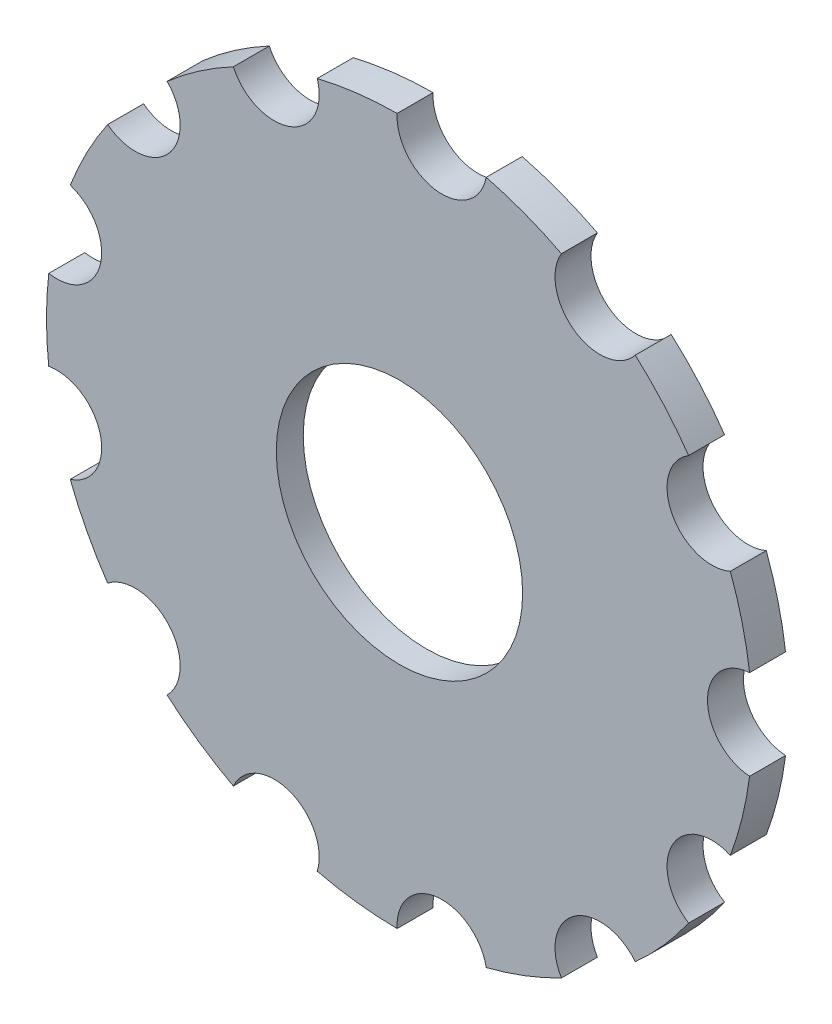
ISO-10303-21;
HEADER;
FILE_DESCRIPTION(('STEP AP214'),'2;1');
FILE_NAME('part.step','',(''),(''),'','','');
FILE_SCHEMA(('AUTOMOTIVE_DESIGN { 1 0 10303 214 1 1 1 1 }'));
ENDSEC;
DATA;
#1=APPLICATION_CONTEXT('core data for automotive mechanical design processes');
#2=APPLICATION_PROTOCOL_DEFINITION('international standard','automotive_design',2000,#1);
#3=PRODUCT_CONTEXT('',#1,'mechanical');
#4=PRODUCT('Part','Part','',(#3));
#5=PRODUCT_RELATED_PRODUCT_CATEGORY('part','',(#4));
#6=PRODUCT_DEFINITION_FORMATION('','',#4);
#7=PRODUCT_DEFINITION_CONTEXT('part definition',#1,'design');
#8=PRODUCT_DEFINITION('design','',#6,#7);
#9=PRODUCT_DEFINITION_SHAPE('','',#8);
#10=(LENGTH_UNIT() NAMED_UNIT(*) SI_UNIT(.MILLI.,.METRE.));
#11=(NAMED_UNIT(*) PLANE_ANGLE_UNIT() SI_UNIT($,.RADIAN.));
#12=(NAMED_UNIT(*) SI_UNIT($,.STERADIAN.) SOLID_ANGLE_UNIT());
#13=UNCERTAINTY_MEASURE_WITH_UNIT(LENGTH_MEASURE(1.E-05),#10,'distance_accuracy_value','');
#14=(GEOMETRIC_REPRESENTATION_CONTEXT(3) GLOBAL_UNCERTAINTY_ASSIGNED_CONTEXT((#13)) GLOBAL_UNIT_ASSIGNED_CONTEXT((#10,
#11,#12)) REPRESENTATION_CONTEXT('',''));
#15=CARTESIAN_POINT('',(0.,0.,0.));
#16=DIRECTION('',(0.,0.,1.));
#17=DIRECTION('',(1.,0.,0.));
#18=AXIS2_PLACEMENT_3D('',#15,#16,#17);
#19=CARTESIAN_POINT('',(-15.5805942177773,3.11525240540506,-0.508));
#20=DIRECTION('',(0.,0.,-1.));
#21=DIRECTION('',(-1.,0.,0.));
#22=AXIS2_PLACEMENT_3D('',#19,#20,#21);
#23=CYLINDRICAL_SURFACE('',#22,2.921);
#24=CARTESIAN_POINT('',(-15.5805942177773,3.11525240540506,-0.381));
#25=DIRECTION('',(0.,0.,-1.));
#26=DIRECTION('',(-1.,0.,0.));
#27=AXIS2_PLACEMENT_3D('',#24,#25,#26);
#28=CIRCLE('',#27,2.921);
#29=CARTESIAN_POINT('',(-18.5015942177773,3.11525240540506,-0.381));
#30=VERTEX_POINT('',#29);
#31=EDGE_CURVE('E203',#30,#30,#28,.T.);
#32=ORIENTED_EDGE('',*,*,#31,.F.);
#33=EDGE_LOOP('',(#32));
#34=FACE_BOUND('',#33,.T.);
#35=CARTESIAN_POINT('',(-15.5805942177773,3.11525240540506,-0.508));
#36=DIRECTION('',(0.,0.,-1.));
#37=DIRECTION('',(-1.,0.,0.));
#38=AXIS2_PLACEMENT_3D('',#35,#36,#37);
#39=CIRCLE('',#38,2.921);
#40=CARTESIAN_POINT('',(-18.5015942177773,3.11525240540506,-0.508));
#41=VERTEX_POINT('',#40);
#42=EDGE_CURVE('E195',#41,#41,#39,.F.);
#43=ORIENTED_EDGE('',*,*,#42,.F.);
#44=EDGE_LOOP('',(#43));
#45=FACE_BOUND('',#44,.T.);
#46=ADVANCED_FACE('F17',(#34,#45),#23,.F.);
#47=CARTESIAN_POINT('',(-21.5638374260941,9.09849561372188,-0.508));
#48=DIRECTION('',(0.,0.,-1.));
#49=DIRECTION('',(-1.,0.,0.));
#50=AXIS2_PLACEMENT_3D('',#47,#48,#49);
#51=PLANE('',#50);
#52=ORIENTED_EDGE('',*,*,#42,.T.);
#53=EDGE_LOOP('',(#52));
#54=FACE_BOUND('',#53,.T.);
#55=CARTESIAN_POINT('',(-15.5805942177773,3.11525240540506,-0.508));
#56=DIRECTION('',(0.,0.,-1.));
#57=DIRECTION('',(-1.,0.,0.));
#58=AXIS2_PLACEMENT_3D('',#55,#56,#57);
#59=CIRCLE('',#58,4.98599692472161);
#60=CARTESIAN_POINT('',(-11.496017610578,5.9746927830408,-0.508));
#61=VERTEX_POINT('',#60);
#62=CARTESIAN_POINT('',(-12.2496612179732,6.82538052774127,-0.508));
#63=VERTEX_POINT('',#62);
#64=EDGE_CURVE('E218',#61,#63,#59,.F.);
#65=ORIENTED_EDGE('',*,*,#64,.F.);
#66=CARTESIAN_POINT('',(-11.1657132265616,5.43236076858879,-0.508));
#67=DIRECTION('',(0.,0.,-1.));
#68=DIRECTION('',(-1.,0.,0.));
#69=AXIS2_PLACEMENT_3D('',#66,#67,#68);
#70=CIRCLE('',#69,0.635);
#71=CARTESIAN_POINT('',(-10.9070169901104,4.85244589790002,-0.508));
#72=VERTEX_POINT('',#71);
#73=EDGE_CURVE('E194',#61,#72,#70,.F.);
#74=ORIENTED_EDGE('',*,*,#73,.T.);
#75=CARTESIAN_POINT('',(-15.5805942177773,3.11525240540506,-0.508));
#76=DIRECTION('',(0.,0.,-1.));
#77=DIRECTION('',(-1.,0.,0.));
#78=AXIS2_PLACEMENT_3D('',#75,#76,#77);
#79=CIRCLE('',#78,4.98599692472161);
#80=CARTESIAN_POINT('',(-10.6350330380118,3.748963657104,-0.508));
#81=VERTEX_POINT('',#80);
#82=EDGE_CURVE('E20',#72,#81,#79,.T.);
#83=ORIENTED_EDGE('',*,*,#82,.T.);
#84=CARTESIAN_POINT('',(-10.5945972930556,3.11525240540506,-0.508));
#85=DIRECTION('',(0.,0.,-1.));
#86=DIRECTION('',(-1.,0.,0.));
#87=AXIS2_PLACEMENT_3D('',#84,#85,#86);
#88=CIRCLE('',#87,0.635);
#89=CARTESIAN_POINT('',(-10.6350330380118,2.48154115370611,-0.508));
#90=VERTEX_POINT('',#89);
#91=EDGE_CURVE('E191',#81,#90,#88,.F.);
#92=ORIENTED_EDGE('',*,*,#91,.T.);
#93=CARTESIAN_POINT('',(-15.5805942177773,3.11525240540506,-0.508));
#94=DIRECTION('',(0.,0.,-1.));
#95=DIRECTION('',(-1.,0.,0.));
#96=AXIS2_PLACEMENT_3D('',#93,#94,#95);
#97=CIRCLE('',#96,4.98599692472161);
#98=CARTESIAN_POINT('',(-10.9070173949228,1.37805782384234,-0.508));
#99=VERTEX_POINT('',#98);
#100=EDGE_CURVE('E202',#99,#90,#97,.F.);
#101=ORIENTED_EDGE('',*,*,#100,.F.);
#102=CARTESIAN_POINT('',(-11.1657137665096,0.798143013436689,-0.508));
#103=DIRECTION('',(0.,0.,-1.));
#104=DIRECTION('',(-1.,0.,0.));
#105=AXIS2_PLACEMENT_3D('',#102,#103,#104);
#106=CIRCLE('',#105,0.635);
#107=CARTESIAN_POINT('',(-11.4960182769037,0.255811075954404,-0.508));
#108=VERTEX_POINT('',#107);
#109=EDGE_CURVE('E292',#99,#108,#106,.F.);
#110=ORIENTED_EDGE('',*,*,#109,.T.);
#111=CARTESIAN_POINT('',(-15.5805942177773,3.11525240540506,-0.508));
#112=DIRECTION('',(0.,0.,-1.));
#113=DIRECTION('',(-1.,0.,0.));
#114=AXIS2_PLACEMENT_3D('',#111,#112,#113);
#115=CIRCLE('',#114,4.98599692472161);
#116=CARTESIAN_POINT('',(-12.2496609709565,-0.594875495160878,-0.508));
#117=VERTEX_POINT('',#116);
#118=EDGE_CURVE('E288',#117,#108,#115,.F.);
#119=ORIENTED_EDGE('',*,*,#118,.F.);
#120=CARTESIAN_POINT('',(-12.7482249694098,-0.988142502989223,-0.508));
#121=DIRECTION('',(0.,0.,-1.));
#122=DIRECTION('',(-1.,0.,0.));
#123=AXIS2_PLACEMENT_3D('',#120,#121,#122);
#124=CIRCLE('',#123,0.635);
#125=CARTESIAN_POINT('',(-13.2927292130248,-1.31485358129126,-0.508));
#126=VERTEX_POINT('',#125);
#127=EDGE_CURVE('E285',#117,#126,#124,.F.);
#128=ORIENTED_EDGE('',*,*,#127,.T.);
#129=CARTESIAN_POINT('',(-15.5805942177773,3.11525240540506,-0.508));
#130=DIRECTION('',(0.,0.,-1.));
#131=DIRECTION('',(-1.,0.,0.));
#132=AXIS2_PLACEMENT_3D('',#129,#130,#131);
#133=CIRCLE('',#132,4.98599692472161);
#134=CARTESIAN_POINT('',(-14.3553828980967,-1.71786486561788,-0.508));
#135=VERTEX_POINT('',#134);
#136=EDGE_CURVE('E281',#135,#126,#133,.F.);
#137=ORIENTED_EDGE('',*,*,#136,.F.);
#138=CARTESIAN_POINT('',(-14.9795997146848,-1.83439111111067,-0.508));
#139=DIRECTION('',(0.,0.,-1.));
#140=DIRECTION('',(-1.,0.,0.));
#141=AXIS2_PLACEMENT_3D('',#138,#139,#140);
#142=CIRCLE('',#141,0.635);
#143=CARTESIAN_POINT('',(-15.6135644957478,-1.8706355089091,-0.508));
#144=VERTEX_POINT('',#143);
#145=EDGE_CURVE('E278',#135,#144,#142,.F.);
#146=ORIENTED_EDGE('',*,*,#145,.T.);
#147=CARTESIAN_POINT('',(-15.5805942177773,3.11525240540506,-0.508));
#148=DIRECTION('',(0.,0.,-1.));
#149=DIRECTION('',(-1.,0.,0.));
#150=AXIS2_PLACEMENT_3D('',#147,#148,#149);
#151=CIRCLE('',#150,4.98599692472161);
#152=CARTESIAN_POINT('',(-16.7417836704437,-1.73364482884827,-0.508));
#153=VERTEX_POINT('',#152);
#154=EDGE_CURVE('E274',#153,#144,#151,.F.);
#155=ORIENTED_EDGE('',*,*,#154,.F.);
#156=CARTESIAN_POINT('',(-17.3486527120433,-1.54673585006997,-0.508));
#157=DIRECTION('',(0.,0.,-1.));
#158=DIRECTION('',(-1.,0.,0.));
#159=AXIS2_PLACEMENT_3D('',#156,#157,#158);
#160=CIRCLE('',#159,0.635);
#161=CARTESIAN_POINT('',(-17.9268443342939,-1.28421071230362,-0.508));
#162=VERTEX_POINT('',#161);
#163=EDGE_CURVE('E271',#153,#162,#160,.F.);
#164=ORIENTED_EDGE('',*,*,#163,.T.);
#165=CARTESIAN_POINT('',(-15.5805942177773,3.11525240540506,-0.508));
#166=DIRECTION('',(0.,0.,-1.));
#167=DIRECTION('',(-1.,0.,0.));
#168=AXIS2_PLACEMENT_3D('',#165,#166,#167);
#169=CIRCLE('',#168,4.98599692472161);
#170=CARTESIAN_POINT('',(-18.8621712422813,-0.638601289876719,-0.508));
#171=VERTEX_POINT('',#170);
#172=EDGE_CURVE('E267',#171,#162,#169,.F.);
#173=ORIENTED_EDGE('',*,*,#172,.F.);
#174=CARTESIAN_POINT('',(-19.3126661676147,-0.191075511570209,-0.508));
#175=DIRECTION('',(0.,0.,-1.));
#176=DIRECTION('',(-1.,0.,0.));
#177=AXIS2_PLACEMENT_3D('',#174,#175,#176);
#178=CIRCLE('',#177,0.635);
#179=CARTESIAN_POINT('',(-19.7026279190212,0.310077990303157,-0.508));
#180=VERTEX_POINT('',#179);
#181=EDGE_CURVE('E264',#171,#180,#178,.F.);
#182=ORIENTED_EDGE('',*,*,#181,.T.);
#183=CARTESIAN_POINT('',(-15.5805942177773,3.11525240540506,-0.508));
#184=DIRECTION('',(0.,0.,-1.));
#185=DIRECTION('',(-1.,0.,0.));
#186=AXIS2_PLACEMENT_3D('',#183,#184,#185);
#187=CIRCLE('',#186,4.98599692472161);
#188=CARTESIAN_POINT('',(-20.2307891275781,1.31640482036747,-0.508));
#189=VERTEX_POINT('',#188);
#190=EDGE_CURVE('E260',#189,#180,#187,.F.);
#191=ORIENTED_EDGE('',*,*,#190,.F.);
#192=CARTESIAN_POINT('',(-20.4217069868815,1.92202464418356,-0.508));
#193=DIRECTION('',(0.,0.,-1.));
#194=DIRECTION('',(-1.,0.,0.));
#195=AXIS2_PLACEMENT_3D('',#192,#193,#194);
#196=CIRCLE('',#195,0.635);
#197=CARTESIAN_POINT('',(-20.5341033371704,2.54699829198141,-0.508));
#198=VERTEX_POINT('',#197);
#199=EDGE_CURVE('E257',#189,#198,#196,.F.);
#200=ORIENTED_EDGE('',*,*,#199,.T.);
#201=CARTESIAN_POINT('',(-15.5805942177773,3.11525240540506,-0.508));
#202=DIRECTION('',(0.,0.,-1.));
#203=DIRECTION('',(-1.,0.,0.));
#204=AXIS2_PLACEMENT_3D('',#201,#202,#203);
#205=CIRCLE('',#204,4.98599692472161);
#206=CARTESIAN_POINT('',(-20.5341033371704,3.68350651882868,-0.508));
#207=VERTEX_POINT('',#206);
#208=EDGE_CURVE('E253',#207,#198,#205,.F.);
#209=ORIENTED_EDGE('',*,*,#208,.F.);
#210=CARTESIAN_POINT('',(-20.4217069868815,4.30848016662652,-0.508));
#211=DIRECTION('',(0.,0.,-1.));
#212=DIRECTION('',(-1.,0.,0.));
#213=AXIS2_PLACEMENT_3D('',#210,#211,#212);
#214=CIRCLE('',#213,0.635);
#215=CARTESIAN_POINT('',(-20.2307891275781,4.91409999044262,-0.508));
#216=VERTEX_POINT('',#215);
#217=EDGE_CURVE('E250',#207,#216,#214,.F.);
#218=ORIENTED_EDGE('',*,*,#217,.T.);
#219=CARTESIAN_POINT('',(-15.5805942177773,3.11525240540506,-0.508));
#220=DIRECTION('',(0.,0.,-1.));
#221=DIRECTION('',(-1.,0.,0.));
#222=AXIS2_PLACEMENT_3D('',#219,#220,#221);
#223=CIRCLE('',#222,4.98599692472161);
#224=CARTESIAN_POINT('',(-19.7026279190212,5.92042682050693,-0.508));
#225=VERTEX_POINT('',#224);
#226=EDGE_CURVE('E246',#225,#216,#223,.F.);
#227=ORIENTED_EDGE('',*,*,#226,.F.);
#228=CARTESIAN_POINT('',(-19.3126661676147,6.42158032238029,-0.508));
#229=DIRECTION('',(0.,0.,-1.));
#230=DIRECTION('',(-1.,0.,0.));
#231=AXIS2_PLACEMENT_3D('',#228,#229,#230);
#232=CIRCLE('',#231,0.635);
#233=CARTESIAN_POINT('',(-18.8621712422813,6.86910610068682,-0.508));
#234=VERTEX_POINT('',#233);
#235=EDGE_CURVE('E243',#225,#234,#232,.F.);
#236=ORIENTED_EDGE('',*,*,#235,.T.);
#237=CARTESIAN_POINT('',(-15.5805942177773,3.11525240540506,-0.508));
#238=DIRECTION('',(0.,0.,-1.));
#239=DIRECTION('',(-1.,0.,0.));
#240=AXIS2_PLACEMENT_3D('',#237,#238,#239);
#241=CIRCLE('',#240,4.98599692472161);
#242=CARTESIAN_POINT('',(-17.9268449201179,7.51471521069159,-0.508));
#243=VERTEX_POINT('',#242);
#244=EDGE_CURVE('E239',#243,#234,#241,.F.);
#245=ORIENTED_EDGE('',*,*,#244,.F.);
#246=CARTESIAN_POINT('',(-17.3486533328246,7.77724042544877,-0.508));
#247=DIRECTION('',(0.,0.,-1.));
#248=DIRECTION('',(-1.,0.,0.));
#249=AXIS2_PLACEMENT_3D('',#246,#247,#248);
#250=CIRCLE('',#249,0.635);
#251=CARTESIAN_POINT('',(-16.7417843161134,7.96414948503661,-0.508));
#252=VERTEX_POINT('',#251);
#253=EDGE_CURVE('E236',#243,#252,#250,.F.);
#254=ORIENTED_EDGE('',*,*,#253,.T.);
#255=CARTESIAN_POINT('',(-15.5805942177773,3.11525240540506,-0.508));
#256=DIRECTION('',(0.,0.,-1.));
#257=DIRECTION('',(-1.,0.,0.));
#258=AXIS2_PLACEMENT_3D('',#255,#256,#257);
#259=CIRCLE('',#258,4.98599692472161);
#260=CARTESIAN_POINT('',(-15.6135631679255,8.10114032849954,-0.508));
#261=VERTEX_POINT('',#260);
#262=EDGE_CURVE('E232',#261,#252,#259,.F.);
#263=ORIENTED_EDGE('',*,*,#262,.F.);
#264=CARTESIAN_POINT('',(-14.979598396515,8.06489576186606,-0.508));
#265=DIRECTION('',(0.,0.,-1.));
#266=DIRECTION('',(-1.,0.,0.));
#267=AXIS2_PLACEMENT_3D('',#264,#265,#266);
#268=CIRCLE('',#267,0.635);
#269=CARTESIAN_POINT('',(-14.3553816109598,7.9483693501343,-0.508));
#270=VERTEX_POINT('',#269);
#271=EDGE_CURVE('E229',#261,#270,#268,.F.);
#272=ORIENTED_EDGE('',*,*,#271,.T.);
#273=CARTESIAN_POINT('',(-15.5805942177773,3.11525240540506,-0.508));
#274=DIRECTION('',(0.,0.,-1.));
#275=DIRECTION('',(-1.,0.,0.));
#276=AXIS2_PLACEMENT_3D('',#273,#274,#275);
#277=CIRCLE('',#276,4.98599692472161);
#278=CARTESIAN_POINT('',(-13.292729507977,7.54535854442518,-0.508));
#279=VERTEX_POINT('',#278);
#280=EDGE_CURVE('E225',#279,#270,#277,.F.);
#281=ORIENTED_EDGE('',*,*,#280,.F.);
#282=CARTESIAN_POINT('',(-12.7482252426099,7.21864750237569,-0.508));
#283=DIRECTION('',(0.,0.,-1.));
#284=DIRECTION('',(-1.,0.,0.));
#285=AXIS2_PLACEMENT_3D('',#282,#283,#284);
#286=CIRCLE('',#285,0.635);
#287=EDGE_CURVE('E222',#279,#63,#286,.F.);
#288=ORIENTED_EDGE('',*,*,#287,.T.);
#289=EDGE_LOOP('',(#65,#74,#83,#92,#101,#110,#119,#128,#137,#146,#155,#164,#173,#182,#191,#200,
#209,#218,#227,#236,#245,#254,#263,#272,#281,#288));
#290=FACE_BOUND('',#289,.T.);
#291=ADVANCED_FACE('F190',(#54,#290),#51,.T.);
#292=CARTESIAN_POINT('',(-12.0753473191312,6.62049930405822,-0.381));
#293=DIRECTION('',(0.,0.,-1.));
#294=DIRECTION('',(-1.,0.,0.));
#295=AXIS2_PLACEMENT_3D('',#292,#293,#294);
#296=PLANE('',#295);
#297=CARTESIAN_POINT('',(-15.5805942177773,3.11525240540506,-0.381));
#298=DIRECTION('',(0.,0.,-1.));
#299=DIRECTION('',(-1.,0.,0.));
#300=AXIS2_PLACEMENT_3D('',#297,#298,#299);
#301=CIRCLE('',#300,1.7399);
#302=CARTESIAN_POINT('',(-17.3204942177773,3.11525240540506,-0.381));
#303=VERTEX_POINT('',#302);
#304=EDGE_CURVE('E206',#303,#303,#301,.F.);
#305=ORIENTED_EDGE('',*,*,#304,.T.);
#306=EDGE_LOOP('',(#305));
#307=FACE_BOUND('',#306,.T.);
#308=ORIENTED_EDGE('',*,*,#31,.T.);
#309=EDGE_LOOP('',(#308));
#310=FACE_BOUND('',#309,.T.);
#311=ADVANCED_FACE('F414',(#307,#310),#296,.T.);
#312=CARTESIAN_POINT('',(-10.5945972930556,3.11525240540506,-0.508));
#313=DIRECTION('',(0.,0.,-1.));
#314=DIRECTION('',(-1.,0.,0.));
#315=AXIS2_PLACEMENT_3D('',#312,#313,#314);
#316=CYLINDRICAL_SURFACE('',#315,0.635);
#317=DIRECTION('',(0.,0.,-1.));
#318=VECTOR('',#317,1.);
#319=CARTESIAN_POINT('',(-10.6350330380118,2.48154115370612,0.));
#320=LINE('',#319,#318);
#321=CARTESIAN_POINT('',(-10.6350330380118,2.48154115370611,0.));
#322=VERTEX_POINT('',#321);
#323=EDGE_CURVE('E201',#90,#322,#320,.F.);
#324=ORIENTED_EDGE('',*,*,#323,.F.);
#325=ORIENTED_EDGE('',*,*,#91,.F.);
#326=DIRECTION('',(0.,0.,-1.));
#327=VECTOR('',#326,1.);
#328=CARTESIAN_POINT('',(-10.6350330380118,3.748963657104,0.));
#329=LINE('',#328,#327);
#330=CARTESIAN_POINT('',(-10.6350330380118,3.748963657104,0.));
#331=VERTEX_POINT('',#330);
#332=EDGE_CURVE('E200',#331,#81,#329,.T.);
#333=ORIENTED_EDGE('',*,*,#332,.F.);
#334=CARTESIAN_POINT('',(-10.5945972930556,3.11525240540506,0.));
#335=DIRECTION('',(0.,0.,-1.));
#336=DIRECTION('',(-1.,0.,0.));
#337=AXIS2_PLACEMENT_3D('',#334,#335,#336);
#338=CIRCLE('',#337,0.635);
#339=EDGE_CURVE('E209',#331,#322,#338,.F.);
#340=ORIENTED_EDGE('',*,*,#339,.T.);
#341=EDGE_LOOP('',(#324,#325,#333,#340));
#342=FACE_BOUND('',#341,.T.);
#343=ADVANCED_FACE('F198',(#342),#316,.F.);
#344=CARTESIAN_POINT('',(-15.5805942177773,3.11525240540506,0.));
#345=DIRECTION('',(0.,0.,-1.));
#346=DIRECTION('',(-1.,0.,0.));
#347=AXIS2_PLACEMENT_3D('',#344,#345,#346);
#348=CYLINDRICAL_SURFACE('',#347,4.98599692472161);
#349=CARTESIAN_POINT('',(-15.5805942177773,3.11525240540506,0.));
#350=DIRECTION('',(0.,0.,-1.));
#351=DIRECTION('',(-1.,0.,0.));
#352=AXIS2_PLACEMENT_3D('',#349,#350,#351);
#353=CIRCLE('',#352,4.98599692472161);
#354=CARTESIAN_POINT('',(-10.9070173949228,1.37805782384234,0.));
#355=VERTEX_POINT('',#354);
#356=EDGE_CURVE('E364',#322,#355,#353,.T.);
#357=ORIENTED_EDGE('',*,*,#356,.T.);
#358=DIRECTION('',(0.,0.,-1.));
#359=VECTOR('',#358,1.);
#360=CARTESIAN_POINT('',(-10.9070173949228,1.37805782384234,-0.508));
#361=LINE('',#360,#359);
#362=EDGE_CURVE('E289',#355,#99,#361,.T.);
#363=ORIENTED_EDGE('',*,*,#362,.T.);
#364=ORIENTED_EDGE('',*,*,#100,.T.);
#365=ORIENTED_EDGE('',*,*,#323,.T.);
#366=EDGE_LOOP('',(#357,#363,#364,#365));
#367=FACE_BOUND('',#366,.T.);
#368=ADVANCED_FACE('F522',(#367),#348,.T.);
#369=CARTESIAN_POINT('',(-11.1657137665096,0.798143013436689,-0.508));
#370=DIRECTION('',(0.,0.,-1.));
#371=DIRECTION('',(-1.,0.,0.));
#372=AXIS2_PLACEMENT_3D('',#369,#370,#371);
#373=CYLINDRICAL_SURFACE('',#372,0.635);
#374=DIRECTION('',(0.,0.,-1.));
#375=VECTOR('',#374,1.);
#376=CARTESIAN_POINT('',(-11.4960182769037,0.255811075954403,0.));
#377=LINE('',#376,#375);
#378=CARTESIAN_POINT('',(-11.4960182769037,0.255811075954404,0.));
#379=VERTEX_POINT('',#378);
#380=EDGE_CURVE('E286',#108,#379,#377,.F.);
#381=ORIENTED_EDGE('',*,*,#380,.F.);
#382=ORIENTED_EDGE('',*,*,#109,.F.);
#383=ORIENTED_EDGE('',*,*,#362,.F.);
#384=CARTESIAN_POINT('',(-11.1657137665096,0.798143013436689,0.));
#385=DIRECTION('',(0.,0.,-1.));
#386=DIRECTION('',(-1.,0.,0.));
#387=AXIS2_PLACEMENT_3D('',#384,#385,#386);
#388=CIRCLE('',#387,0.635);
#389=EDGE_CURVE('E361',#355,#379,#388,.F.);
#390=ORIENTED_EDGE('',*,*,#389,.T.);
#391=EDGE_LOOP('',(#381,#382,#383,#390));
#392=FACE_BOUND('',#391,.T.);
#393=ADVANCED_FACE('F518',(#392),#373,.F.);
#394=CARTESIAN_POINT('',(-15.5805942177773,3.11525240540506,0.));
#395=DIRECTION('',(0.,0.,-1.));
#396=DIRECTION('',(-1.,0.,0.));
#397=AXIS2_PLACEMENT_3D('',#394,#395,#396);
#398=CYLINDRICAL_SURFACE('',#397,4.98599692472161);
#399=ORIENTED_EDGE('',*,*,#118,.T.);
#400=ORIENTED_EDGE('',*,*,#380,.T.);
#401=CARTESIAN_POINT('',(-15.5805942177773,3.11525240540506,0.));
#402=DIRECTION('',(0.,0.,-1.));
#403=DIRECTION('',(-1.,0.,0.));
#404=AXIS2_PLACEMENT_3D('',#401,#402,#403);
#405=CIRCLE('',#404,4.98599692472161);
#406=CARTESIAN_POINT('',(-12.2496609709565,-0.594875495160878,0.));
#407=VERTEX_POINT('',#406);
#408=EDGE_CURVE('E358',#379,#407,#405,.T.);
#409=ORIENTED_EDGE('',*,*,#408,.T.);
#410=DIRECTION('',(0.,0.,-1.));
#411=VECTOR('',#410,1.);
#412=CARTESIAN_POINT('',(-12.2496609709565,-0.594875495160878,-0.508));
#413=LINE('',#412,#411);
#414=EDGE_CURVE('E282',#407,#117,#413,.T.);
#415=ORIENTED_EDGE('',*,*,#414,.T.);
#416=EDGE_LOOP('',(#399,#400,#409,#415));
#417=FACE_BOUND('',#416,.T.);
#418=ADVANCED_FACE('F514',(#417),#398,.T.);
#419=CARTESIAN_POINT('',(-12.7482249694098,-0.988142502989223,-0.508));
#420=DIRECTION('',(0.,0.,-1.));
#421=DIRECTION('',(-1.,0.,0.));
#422=AXIS2_PLACEMENT_3D('',#419,#420,#421);
#423=CYLINDRICAL_SURFACE('',#422,0.635);
#424=DIRECTION('',(0.,0.,-1.));
#425=VECTOR('',#424,1.);
#426=CARTESIAN_POINT('',(-13.2927292130248,-1.31485358129126,0.));
#427=LINE('',#426,#425);
#428=CARTESIAN_POINT('',(-13.2927292130248,-1.31485358129126,0.));
#429=VERTEX_POINT('',#428);
#430=EDGE_CURVE('E279',#126,#429,#427,.F.);
#431=ORIENTED_EDGE('',*,*,#430,.F.);
#432=ORIENTED_EDGE('',*,*,#127,.F.);
#433=ORIENTED_EDGE('',*,*,#414,.F.);
#434=CARTESIAN_POINT('',(-12.7482249694098,-0.988142502989223,0.));
#435=DIRECTION('',(0.,0.,-1.));
#436=DIRECTION('',(-1.,0.,0.));
#437=AXIS2_PLACEMENT_3D('',#434,#435,#436);
#438=CIRCLE('',#437,0.635);
#439=EDGE_CURVE('E355',#407,#429,#438,.F.);
#440=ORIENTED_EDGE('',*,*,#439,.T.);
#441=EDGE_LOOP('',(#431,#432,#433,#440));
#442=FACE_BOUND('',#441,.T.);
#443=ADVANCED_FACE('F510',(#442),#423,.F.);
#444=CARTESIAN_POINT('',(-15.5805942177773,3.11525240540506,0.));
#445=DIRECTION('',(0.,0.,-1.));
#446=DIRECTION('',(-1.,0.,0.));
#447=AXIS2_PLACEMENT_3D('',#444,#445,#446);
#448=CYLINDRICAL_SURFACE('',#447,4.98599692472161);
#449=ORIENTED_EDGE('',*,*,#136,.T.);
#450=ORIENTED_EDGE('',*,*,#430,.T.);
#451=CARTESIAN_POINT('',(-15.5805942177773,3.11525240540506,0.));
#452=DIRECTION('',(0.,0.,-1.));
#453=DIRECTION('',(-1.,0.,0.));
#454=AXIS2_PLACEMENT_3D('',#451,#452,#453);
#455=CIRCLE('',#454,4.98599692472161);
#456=CARTESIAN_POINT('',(-14.3553828980967,-1.71786486561788,0.));
#457=VERTEX_POINT('',#456);
#458=EDGE_CURVE('E352',#429,#457,#455,.T.);
#459=ORIENTED_EDGE('',*,*,#458,.T.);
#460=DIRECTION('',(0.,0.,-1.));
#461=VECTOR('',#460,1.);
#462=CARTESIAN_POINT('',(-14.3553828980967,-1.71786486561788,-0.508));
#463=LINE('',#462,#461);
#464=EDGE_CURVE('E275',#457,#135,#463,.T.);
#465=ORIENTED_EDGE('',*,*,#464,.T.);
#466=EDGE_LOOP('',(#449,#450,#459,#465));
#467=FACE_BOUND('',#466,.T.);
#468=ADVANCED_FACE('F506',(#467),#448,.T.);
#469=CARTESIAN_POINT('',(-14.9795997146848,-1.83439111111067,-0.508));
#470=DIRECTION('',(0.,0.,-1.));
#471=DIRECTION('',(-1.,0.,0.));
#472=AXIS2_PLACEMENT_3D('',#469,#470,#471);
#473=CYLINDRICAL_SURFACE('',#472,0.635);
#474=DIRECTION('',(0.,0.,-1.));
#475=VECTOR('',#474,1.);
#476=CARTESIAN_POINT('',(-15.6135644957478,-1.8706355089091,0.));
#477=LINE('',#476,#475);
#478=CARTESIAN_POINT('',(-15.6135644957478,-1.8706355089091,0.));
#479=VERTEX_POINT('',#478);
#480=EDGE_CURVE('E272',#144,#479,#477,.F.);
#481=ORIENTED_EDGE('',*,*,#480,.F.);
#482=ORIENTED_EDGE('',*,*,#145,.F.);
#483=ORIENTED_EDGE('',*,*,#464,.F.);
#484=CARTESIAN_POINT('',(-14.9795997146848,-1.83439111111067,0.));
#485=DIRECTION('',(0.,0.,-1.));
#486=DIRECTION('',(-1.,0.,0.));
#487=AXIS2_PLACEMENT_3D('',#484,#485,#486);
#488=CIRCLE('',#487,0.635);
#489=EDGE_CURVE('E349',#457,#479,#488,.F.);
#490=ORIENTED_EDGE('',*,*,#489,.T.);
#491=EDGE_LOOP('',(#481,#482,#483,#490));
#492=FACE_BOUND('',#491,.T.);
#493=ADVANCED_FACE('F502',(#492),#473,.F.);
#494=CARTESIAN_POINT('',(-15.5805942177773,3.11525240540506,0.));
#495=DIRECTION('',(0.,0.,-1.));
#496=DIRECTION('',(-1.,0.,0.));
#497=AXIS2_PLACEMENT_3D('',#494,#495,#496);
#498=CYLINDRICAL_SURFACE('',#497,4.98599692472161);
#499=ORIENTED_EDGE('',*,*,#154,.T.);
#500=ORIENTED_EDGE('',*,*,#480,.T.);
#501=CARTESIAN_POINT('',(-15.5805942177773,3.11525240540506,0.));
#502=DIRECTION('',(0.,0.,-1.));
#503=DIRECTION('',(-1.,0.,0.));
#504=AXIS2_PLACEMENT_3D('',#501,#502,#503);
#505=CIRCLE('',#504,4.98599692472161);
#506=CARTESIAN_POINT('',(-16.7417836704437,-1.73364482884827,0.));
#507=VERTEX_POINT('',#506);
#508=EDGE_CURVE('E346',#479,#507,#505,.T.);
#509=ORIENTED_EDGE('',*,*,#508,.T.);
#510=DIRECTION('',(0.,0.,-1.));
#511=VECTOR('',#510,1.);
#512=CARTESIAN_POINT('',(-16.7417836704437,-1.73364482884827,-0.508));
#513=LINE('',#512,#511);
#514=EDGE_CURVE('E268',#507,#153,#513,.T.);
#515=ORIENTED_EDGE('',*,*,#514,.T.);
#516=EDGE_LOOP('',(#499,#500,#509,#515));
#517=FACE_BOUND('',#516,.T.);
#518=ADVANCED_FACE('F498',(#517),#498,.T.);
#519=CARTESIAN_POINT('',(-17.3486527120433,-1.54673585006997,-0.508));
#520=DIRECTION('',(0.,0.,-1.));
#521=DIRECTION('',(-1.,0.,0.));
#522=AXIS2_PLACEMENT_3D('',#519,#520,#521);
#523=CYLINDRICAL_SURFACE('',#522,0.635);
#524=CARTESIAN_POINT('',(-17.3486527120433,-1.54673585006997,0.));
#525=DIRECTION('',(0.,0.,-1.));
#526=DIRECTION('',(-1.,0.,0.));
#527=AXIS2_PLACEMENT_3D('',#524,#525,#526);
#528=CIRCLE('',#527,0.635);
#529=CARTESIAN_POINT('',(-17.9268443342939,-1.28421071230362,0.));
#530=VERTEX_POINT('',#529);
#531=EDGE_CURVE('E343',#507,#530,#528,.F.);
#532=ORIENTED_EDGE('',*,*,#531,.T.);
#533=DIRECTION('',(0.,0.,-1.));
#534=VECTOR('',#533,1.);
#535=CARTESIAN_POINT('',(-17.9268443342939,-1.28421071230362,0.));
#536=LINE('',#535,#534);
#537=EDGE_CURVE('E265',#162,#530,#536,.F.);
#538=ORIENTED_EDGE('',*,*,#537,.F.);
#539=ORIENTED_EDGE('',*,*,#163,.F.);
#540=ORIENTED_EDGE('',*,*,#514,.F.);
#541=EDGE_LOOP('',(#532,#538,#539,#540));
#542=FACE_BOUND('',#541,.T.);
#543=ADVANCED_FACE('F494',(#542),#523,.F.);
#544=CARTESIAN_POINT('',(-15.5805942177773,3.11525240540506,0.));
#545=DIRECTION('',(0.,0.,-1.));
#546=DIRECTION('',(-1.,0.,0.));
#547=AXIS2_PLACEMENT_3D('',#544,#545,#546);
#548=CYLINDRICAL_SURFACE('',#547,4.98599692472161);
#549=ORIENTED_EDGE('',*,*,#172,.T.);
#550=ORIENTED_EDGE('',*,*,#537,.T.);
#551=CARTESIAN_POINT('',(-15.5805942177773,3.11525240540506,0.));
#552=DIRECTION('',(0.,0.,-1.));
#553=DIRECTION('',(-1.,0.,0.));
#554=AXIS2_PLACEMENT_3D('',#551,#552,#553);
#555=CIRCLE('',#554,4.98599692472161);
#556=CARTESIAN_POINT('',(-18.8621712422813,-0.638601289876719,0.));
#557=VERTEX_POINT('',#556);
#558=EDGE_CURVE('E340',#530,#557,#555,.T.);
#559=ORIENTED_EDGE('',*,*,#558,.T.);
#560=DIRECTION('',(0.,0.,-1.));
#561=VECTOR('',#560,1.);
#562=CARTESIAN_POINT('',(-18.8621712422813,-0.638601289876718,-0.508));
#563=LINE('',#562,#561);
#564=EDGE_CURVE('E261',#557,#171,#563,.T.);
#565=ORIENTED_EDGE('',*,*,#564,.T.);
#566=EDGE_LOOP('',(#549,#550,#559,#565));
#567=FACE_BOUND('',#566,.T.);
#568=ADVANCED_FACE('F490',(#567),#548,.T.);
#569=CARTESIAN_POINT('',(-19.3126661676147,-0.191075511570209,-0.508));
#570=DIRECTION('',(0.,0.,-1.));
#571=DIRECTION('',(-1.,0.,0.));
#572=AXIS2_PLACEMENT_3D('',#569,#570,#571);
#573=CYLINDRICAL_SURFACE('',#572,0.635);
#574=CARTESIAN_POINT('',(-19.3126661676147,-0.191075511570209,0.));
#575=DIRECTION('',(0.,0.,-1.));
#576=DIRECTION('',(-1.,0.,0.));
#577=AXIS2_PLACEMENT_3D('',#574,#575,#576);
#578=CIRCLE('',#577,0.635);
#579=CARTESIAN_POINT('',(-19.7026279190212,0.310077990303157,0.));
#580=VERTEX_POINT('',#579);
#581=EDGE_CURVE('E337',#557,#580,#578,.F.);
#582=ORIENTED_EDGE('',*,*,#581,.T.);
#583=DIRECTION('',(0.,0.,-1.));
#584=VECTOR('',#583,1.);
#585=CARTESIAN_POINT('',(-19.7026279190212,0.310077990303153,0.));
#586=LINE('',#585,#584);
#587=EDGE_CURVE('E258',#180,#580,#586,.F.);
#588=ORIENTED_EDGE('',*,*,#587,.F.);
#589=ORIENTED_EDGE('',*,*,#181,.F.);
#590=ORIENTED_EDGE('',*,*,#564,.F.);
#591=EDGE_LOOP('',(#582,#588,#589,#590));
#592=FACE_BOUND('',#591,.T.);
#593=ADVANCED_FACE('F486',(#592),#573,.F.);
#594=CARTESIAN_POINT('',(-15.5805942177773,3.11525240540506,0.));
#595=DIRECTION('',(0.,0.,-1.));
#596=DIRECTION('',(-1.,0.,0.));
#597=AXIS2_PLACEMENT_3D('',#594,#595,#596);
#598=CYLINDRICAL_SURFACE('',#597,4.98599692472161);
#599=ORIENTED_EDGE('',*,*,#190,.T.);
#600=ORIENTED_EDGE('',*,*,#587,.T.);
#601=CARTESIAN_POINT('',(-15.5805942177773,3.11525240540506,0.));
#602=DIRECTION('',(0.,0.,-1.));
#603=DIRECTION('',(-1.,0.,0.));
#604=AXIS2_PLACEMENT_3D('',#601,#602,#603);
#605=CIRCLE('',#604,4.98599692472161);
#606=CARTESIAN_POINT('',(-20.2307891275781,1.31640482036747,0.));
#607=VERTEX_POINT('',#606);
#608=EDGE_CURVE('E334',#580,#607,#605,.T.);
#609=ORIENTED_EDGE('',*,*,#608,.T.);
#610=DIRECTION('',(0.,0.,-1.));
#611=VECTOR('',#610,1.);
#612=CARTESIAN_POINT('',(-20.2307891275781,1.31640482036747,-0.508));
#613=LINE('',#612,#611);
#614=EDGE_CURVE('E254',#607,#189,#613,.T.);
#615=ORIENTED_EDGE('',*,*,#614,.T.);
#616=EDGE_LOOP('',(#599,#600,#609,#615));
#617=FACE_BOUND('',#616,.T.);
#618=ADVANCED_FACE('F482',(#617),#598,.T.);
#619=CARTESIAN_POINT('',(-20.4217069868815,1.92202464418356,-0.508));
#620=DIRECTION('',(0.,0.,-1.));
#621=DIRECTION('',(-1.,0.,0.));
#622=AXIS2_PLACEMENT_3D('',#619,#620,#621);
#623=CYLINDRICAL_SURFACE('',#622,0.635);
#624=CARTESIAN_POINT('',(-20.4217069868815,1.92202464418356,0.));
#625=DIRECTION('',(0.,0.,-1.));
#626=DIRECTION('',(-1.,0.,0.));
#627=AXIS2_PLACEMENT_3D('',#624,#625,#626);
#628=CIRCLE('',#627,0.635);
#629=CARTESIAN_POINT('',(-20.5341033371704,2.54699829198141,0.));
#630=VERTEX_POINT('',#629);
#631=EDGE_CURVE('E331',#607,#630,#628,.F.);
#632=ORIENTED_EDGE('',*,*,#631,.T.);
#633=DIRECTION('',(0.,0.,-1.));
#634=VECTOR('',#633,1.);
#635=CARTESIAN_POINT('',(-20.5341033371704,2.54699829198142,0.));
#636=LINE('',#635,#634);
#637=EDGE_CURVE('E251',#198,#630,#636,.F.);
#638=ORIENTED_EDGE('',*,*,#637,.F.);
#639=ORIENTED_EDGE('',*,*,#199,.F.);
#640=ORIENTED_EDGE('',*,*,#614,.F.);
#641=EDGE_LOOP('',(#632,#638,#639,#640));
#642=FACE_BOUND('',#641,.T.);
#643=ADVANCED_FACE('F478',(#642),#623,.F.);
#644=CARTESIAN_POINT('',(-15.5805942177773,3.11525240540506,0.));
#645=DIRECTION('',(0.,0.,-1.));
#646=DIRECTION('',(-1.,0.,0.));
#647=AXIS2_PLACEMENT_3D('',#644,#645,#646);
#648=CYLINDRICAL_SURFACE('',#647,4.98599692472161);
#649=ORIENTED_EDGE('',*,*,#208,.T.);
#650=ORIENTED_EDGE('',*,*,#637,.T.);
#651=CARTESIAN_POINT('',(-15.5805942177773,3.11525240540506,0.));
#652=DIRECTION('',(0.,0.,-1.));
#653=DIRECTION('',(-1.,0.,0.));
#654=AXIS2_PLACEMENT_3D('',#651,#652,#653);
#655=CIRCLE('',#654,4.98599692472161);
#656=CARTESIAN_POINT('',(-20.5341033371704,3.68350651882868,0.));
#657=VERTEX_POINT('',#656);
#658=EDGE_CURVE('E328',#630,#657,#655,.T.);
#659=ORIENTED_EDGE('',*,*,#658,.T.);
#660=DIRECTION('',(0.,0.,-1.));
#661=VECTOR('',#660,1.);
#662=CARTESIAN_POINT('',(-20.5341033371704,3.68350651882868,-0.508));
#663=LINE('',#662,#661);
#664=EDGE_CURVE('E247',#657,#207,#663,.T.);
#665=ORIENTED_EDGE('',*,*,#664,.T.);
#666=EDGE_LOOP('',(#649,#650,#659,#665));
#667=FACE_BOUND('',#666,.T.);
#668=ADVANCED_FACE('F474',(#667),#648,.T.);
#669=CARTESIAN_POINT('',(-20.4217069868815,4.30848016662652,-0.508));
#670=DIRECTION('',(0.,0.,-1.));
#671=DIRECTION('',(-1.,0.,0.));
#672=AXIS2_PLACEMENT_3D('',#669,#670,#671);
#673=CYLINDRICAL_SURFACE('',#672,0.635);
#674=CARTESIAN_POINT('',(-20.4217069868815,4.30848016662652,0.));
#675=DIRECTION('',(0.,0.,-1.));
#676=DIRECTION('',(-1.,0.,0.));
#677=AXIS2_PLACEMENT_3D('',#674,#675,#676);
#678=CIRCLE('',#677,0.635);
#679=CARTESIAN_POINT('',(-20.2307891275781,4.91409999044262,0.));
#680=VERTEX_POINT('',#679);
#681=EDGE_CURVE('E325',#657,#680,#678,.F.);
#682=ORIENTED_EDGE('',*,*,#681,.T.);
#683=DIRECTION('',(0.,0.,-1.));
#684=VECTOR('',#683,1.);
#685=CARTESIAN_POINT('',(-20.2307891275781,4.91409999044262,0.));
#686=LINE('',#685,#684);
#687=EDGE_CURVE('E244',#216,#680,#686,.F.);
#688=ORIENTED_EDGE('',*,*,#687,.F.);
#689=ORIENTED_EDGE('',*,*,#217,.F.);
#690=ORIENTED_EDGE('',*,*,#664,.F.);
#691=EDGE_LOOP('',(#682,#688,#689,#690));
#692=FACE_BOUND('',#691,.T.);
#693=ADVANCED_FACE('F470',(#692),#673,.F.);
#694=CARTESIAN_POINT('',(-15.5805942177773,3.11525240540506,0.));
#695=DIRECTION('',(0.,0.,-1.));
#696=DIRECTION('',(-1.,0.,0.));
#697=AXIS2_PLACEMENT_3D('',#694,#695,#696);
#698=CYLINDRICAL_SURFACE('',#697,4.98599692472161);
#699=ORIENTED_EDGE('',*,*,#226,.T.);
#700=ORIENTED_EDGE('',*,*,#687,.T.);
#701=CARTESIAN_POINT('',(-15.5805942177773,3.11525240540506,0.));
#702=DIRECTION('',(0.,0.,-1.));
#703=DIRECTION('',(-1.,0.,0.));
#704=AXIS2_PLACEMENT_3D('',#701,#702,#703);
#705=CIRCLE('',#704,4.98599692472161);
#706=CARTESIAN_POINT('',(-19.7026279190212,5.92042682050693,0.));
#707=VERTEX_POINT('',#706);
#708=EDGE_CURVE('E322',#680,#707,#705,.T.);
#709=ORIENTED_EDGE('',*,*,#708,.T.);
#710=DIRECTION('',(0.,0.,-1.));
#711=VECTOR('',#710,1.);
#712=CARTESIAN_POINT('',(-19.7026279190212,5.92042682050692,-0.508));
#713=LINE('',#712,#711);
#714=EDGE_CURVE('E240',#707,#225,#713,.T.);
#715=ORIENTED_EDGE('',*,*,#714,.T.);
#716=EDGE_LOOP('',(#699,#700,#709,#715));
#717=FACE_BOUND('',#716,.T.);
#718=ADVANCED_FACE('F466',(#717),#698,.T.);
#719=CARTESIAN_POINT('',(-19.3126661676147,6.42158032238029,-0.508));
#720=DIRECTION('',(0.,0.,-1.));
#721=DIRECTION('',(-1.,0.,0.));
#722=AXIS2_PLACEMENT_3D('',#719,#720,#721);
#723=CYLINDRICAL_SURFACE('',#722,0.635);
#724=CARTESIAN_POINT('',(-19.3126661676147,6.42158032238029,0.));
#725=DIRECTION('',(0.,0.,-1.));
#726=DIRECTION('',(-1.,0.,0.));
#727=AXIS2_PLACEMENT_3D('',#724,#725,#726);
#728=CIRCLE('',#727,0.635);
#729=CARTESIAN_POINT('',(-18.8621712422813,6.86910610068682,0.));
#730=VERTEX_POINT('',#729);
#731=EDGE_CURVE('E319',#707,#730,#728,.F.);
#732=ORIENTED_EDGE('',*,*,#731,.T.);
#733=DIRECTION('',(0.,0.,-1.));
#734=VECTOR('',#733,1.);
#735=CARTESIAN_POINT('',(-18.8621712422813,6.86910610068683,0.));
#736=LINE('',#735,#734);
#737=EDGE_CURVE('E237',#234,#730,#736,.F.);
#738=ORIENTED_EDGE('',*,*,#737,.F.);
#739=ORIENTED_EDGE('',*,*,#235,.F.);
#740=ORIENTED_EDGE('',*,*,#714,.F.);
#741=EDGE_LOOP('',(#732,#738,#739,#740));
#742=FACE_BOUND('',#741,.T.);
#743=ADVANCED_FACE('F462',(#742),#723,.F.);
#744=CARTESIAN_POINT('',(-15.5805942177773,3.11525240540506,0.));
#745=DIRECTION('',(0.,0.,-1.));
#746=DIRECTION('',(-1.,0.,0.));
#747=AXIS2_PLACEMENT_3D('',#744,#745,#746);
#748=CYLINDRICAL_SURFACE('',#747,4.98599692472161);
#749=ORIENTED_EDGE('',*,*,#244,.T.);
#750=ORIENTED_EDGE('',*,*,#737,.T.);
#751=CARTESIAN_POINT('',(-15.5805942177773,3.11525240540506,0.));
#752=DIRECTION('',(0.,0.,-1.));
#753=DIRECTION('',(-1.,0.,0.));
#754=AXIS2_PLACEMENT_3D('',#751,#752,#753);
#755=CIRCLE('',#754,4.98599692472161);
#756=CARTESIAN_POINT('',(-17.9268449201179,7.51471521069159,0.));
#757=VERTEX_POINT('',#756);
#758=EDGE_CURVE('E316',#730,#757,#755,.T.);
#759=ORIENTED_EDGE('',*,*,#758,.T.);
#760=DIRECTION('',(0.,0.,-1.));
#761=VECTOR('',#760,1.);
#762=CARTESIAN_POINT('',(-17.9268449201179,7.51471521069159,-0.508));
#763=LINE('',#762,#761);
#764=EDGE_CURVE('E233',#757,#243,#763,.T.);
#765=ORIENTED_EDGE('',*,*,#764,.T.);
#766=EDGE_LOOP('',(#749,#750,#759,#765));
#767=FACE_BOUND('',#766,.T.);
#768=ADVANCED_FACE('F458',(#767),#748,.T.);
#769=CARTESIAN_POINT('',(-17.3486533328246,7.77724042544877,-0.508));
#770=DIRECTION('',(0.,0.,-1.));
#771=DIRECTION('',(-1.,0.,0.));
#772=AXIS2_PLACEMENT_3D('',#769,#770,#771);
#773=CYLINDRICAL_SURFACE('',#772,0.635);
#774=CARTESIAN_POINT('',(-17.3486533328246,7.77724042544877,0.));
#775=DIRECTION('',(0.,0.,-1.));
#776=DIRECTION('',(-1.,0.,0.));
#777=AXIS2_PLACEMENT_3D('',#774,#775,#776);
#778=CIRCLE('',#777,0.635);
#779=CARTESIAN_POINT('',(-16.7417843161134,7.96414948503661,0.));
#780=VERTEX_POINT('',#779);
#781=EDGE_CURVE('E313',#757,#780,#778,.F.);
#782=ORIENTED_EDGE('',*,*,#781,.T.);
#783=DIRECTION('',(0.,0.,-1.));
#784=VECTOR('',#783,1.);
#785=CARTESIAN_POINT('',(-16.7417843161134,7.96414948503661,0.));
#786=LINE('',#785,#784);
#787=EDGE_CURVE('E230',#252,#780,#786,.F.);
#788=ORIENTED_EDGE('',*,*,#787,.F.);
#789=ORIENTED_EDGE('',*,*,#253,.F.);
#790=ORIENTED_EDGE('',*,*,#764,.F.);
#791=EDGE_LOOP('',(#782,#788,#789,#790));
#792=FACE_BOUND('',#791,.T.);
#793=ADVANCED_FACE('F454',(#792),#773,.F.);
#794=CARTESIAN_POINT('',(-15.5805942177773,3.11525240540506,0.));
#795=DIRECTION('',(0.,0.,-1.));
#796=DIRECTION('',(-1.,0.,0.));
#797=AXIS2_PLACEMENT_3D('',#794,#795,#796);
#798=CYLINDRICAL_SURFACE('',#797,4.98599692472161);
#799=ORIENTED_EDGE('',*,*,#262,.T.);
#800=ORIENTED_EDGE('',*,*,#787,.T.);
#801=CARTESIAN_POINT('',(-15.5805942177773,3.11525240540506,0.));
#802=DIRECTION('',(0.,0.,-1.));
#803=DIRECTION('',(-1.,0.,0.));
#804=AXIS2_PLACEMENT_3D('',#801,#802,#803);
#805=CIRCLE('',#804,4.98599692472161);
#806=CARTESIAN_POINT('',(-15.6135631679255,8.10114032849954,0.));
#807=VERTEX_POINT('',#806);
#808=EDGE_CURVE('E310',#780,#807,#805,.T.);
#809=ORIENTED_EDGE('',*,*,#808,.T.);
#810=DIRECTION('',(0.,0.,-1.));
#811=VECTOR('',#810,1.);
#812=CARTESIAN_POINT('',(-15.6135631679255,8.10114032849954,-0.508));
#813=LINE('',#812,#811);
#814=EDGE_CURVE('E226',#807,#261,#813,.T.);
#815=ORIENTED_EDGE('',*,*,#814,.T.);
#816=EDGE_LOOP('',(#799,#800,#809,#815));
#817=FACE_BOUND('',#816,.T.);
#818=ADVANCED_FACE('F450',(#817),#798,.T.);
#819=CARTESIAN_POINT('',(-14.979598396515,8.06489576186606,-0.508));
#820=DIRECTION('',(0.,0.,-1.));
#821=DIRECTION('',(-1.,0.,0.));
#822=AXIS2_PLACEMENT_3D('',#819,#820,#821);
#823=CYLINDRICAL_SURFACE('',#822,0.635);
#824=DIRECTION('',(0.,0.,-1.));
#825=VECTOR('',#824,1.);
#826=CARTESIAN_POINT('',(-14.3553816109598,7.9483693501343,0.));
#827=LINE('',#826,#825);
#828=CARTESIAN_POINT('',(-14.3553816109598,7.9483693501343,0.));
#829=VERTEX_POINT('',#828);
#830=EDGE_CURVE('E223',#270,#829,#827,.F.);
#831=ORIENTED_EDGE('',*,*,#830,.F.);
#832=ORIENTED_EDGE('',*,*,#271,.F.);
#833=ORIENTED_EDGE('',*,*,#814,.F.);
#834=CARTESIAN_POINT('',(-14.979598396515,8.06489576186606,0.));
#835=DIRECTION('',(0.,0.,-1.));
#836=DIRECTION('',(-1.,0.,0.));
#837=AXIS2_PLACEMENT_3D('',#834,#835,#836);
#838=CIRCLE('',#837,0.635);
#839=EDGE_CURVE('E307',#807,#829,#838,.F.);
#840=ORIENTED_EDGE('',*,*,#839,.T.);
#841=EDGE_LOOP('',(#831,#832,#833,#840));
#842=FACE_BOUND('',#841,.T.);
#843=ADVANCED_FACE('F446',(#842),#823,.F.);
#844=CARTESIAN_POINT('',(-15.5805942177773,3.11525240540506,0.));
#845=DIRECTION('',(0.,0.,-1.));
#846=DIRECTION('',(-1.,0.,0.));
#847=AXIS2_PLACEMENT_3D('',#844,#845,#846);
#848=CYLINDRICAL_SURFACE('',#847,4.98599692472161);
#849=ORIENTED_EDGE('',*,*,#280,.T.);
#850=ORIENTED_EDGE('',*,*,#830,.T.);
#851=CARTESIAN_POINT('',(-15.5805942177773,3.11525240540506,0.));
#852=DIRECTION('',(0.,0.,-1.));
#853=DIRECTION('',(-1.,0.,0.));
#854=AXIS2_PLACEMENT_3D('',#851,#852,#853);
#855=CIRCLE('',#854,4.98599692472161);
#856=CARTESIAN_POINT('',(-13.292729507977,7.54535854442518,0.));
#857=VERTEX_POINT('',#856);
#858=EDGE_CURVE('E304',#829,#857,#855,.T.);
#859=ORIENTED_EDGE('',*,*,#858,.T.);
#860=DIRECTION('',(0.,0.,-1.));
#861=VECTOR('',#860,1.);
#862=CARTESIAN_POINT('',(-13.292729507977,7.54535854442518,-0.508));
#863=LINE('',#862,#861);
#864=EDGE_CURVE('E219',#857,#279,#863,.T.);
#865=ORIENTED_EDGE('',*,*,#864,.T.);
#866=EDGE_LOOP('',(#849,#850,#859,#865));
#867=FACE_BOUND('',#866,.T.);
#868=ADVANCED_FACE('F442',(#867),#848,.T.);
#869=CARTESIAN_POINT('',(-12.7482252426099,7.21864750237569,-0.508));
#870=DIRECTION('',(0.,0.,-1.));
#871=DIRECTION('',(-1.,0.,0.));
#872=AXIS2_PLACEMENT_3D('',#869,#870,#871);
#873=CYLINDRICAL_SURFACE('',#872,0.635);
#874=DIRECTION('',(0.,0.,-1.));
#875=VECTOR('',#874,1.);
#876=CARTESIAN_POINT('',(-12.2496612179732,6.82538052774126,0.));
#877=LINE('',#876,#875);
#878=CARTESIAN_POINT('',(-12.2496612179732,6.82538052774127,0.));
#879=VERTEX_POINT('',#878);
#880=EDGE_CURVE('E216',#63,#879,#877,.F.);
#881=ORIENTED_EDGE('',*,*,#880,.F.);
#882=ORIENTED_EDGE('',*,*,#287,.F.);
#883=ORIENTED_EDGE('',*,*,#864,.F.);
#884=CARTESIAN_POINT('',(-12.7482252426099,7.21864750237569,0.));
#885=DIRECTION('',(0.,0.,-1.));
#886=DIRECTION('',(-1.,0.,0.));
#887=AXIS2_PLACEMENT_3D('',#884,#885,#886);
#888=CIRCLE('',#887,0.635);
#889=EDGE_CURVE('E301',#857,#879,#888,.F.);
#890=ORIENTED_EDGE('',*,*,#889,.T.);
#891=EDGE_LOOP('',(#881,#882,#883,#890));
#892=FACE_BOUND('',#891,.T.);
#893=ADVANCED_FACE('F438',(#892),#873,.F.);
#894=CARTESIAN_POINT('',(-15.5805942177773,3.11525240540506,0.));
#895=DIRECTION('',(0.,0.,-1.));
#896=DIRECTION('',(-1.,0.,0.));
#897=AXIS2_PLACEMENT_3D('',#894,#895,#896);
#898=CYLINDRICAL_SURFACE('',#897,4.98599692472161);
#899=ORIENTED_EDGE('',*,*,#64,.T.);
#900=ORIENTED_EDGE('',*,*,#880,.T.);
#901=CARTESIAN_POINT('',(-15.5805942177773,3.11525240540506,0.));
#902=DIRECTION('',(0.,0.,-1.));
#903=DIRECTION('',(-1.,0.,0.));
#904=AXIS2_PLACEMENT_3D('',#901,#902,#903);
#905=CIRCLE('',#904,4.98599692472161);
#906=CARTESIAN_POINT('',(-11.496017610578,5.9746927830408,0.));
#907=VERTEX_POINT('',#906);
#908=EDGE_CURVE('E298',#879,#907,#905,.T.);
#909=ORIENTED_EDGE('',*,*,#908,.T.);
#910=DIRECTION('',(0.,0.,-1.));
#911=VECTOR('',#910,1.);
#912=CARTESIAN_POINT('',(-11.496017610578,5.9746927830408,-0.508));
#913=LINE('',#912,#911);
#914=EDGE_CURVE('E213',#907,#61,#913,.T.);
#915=ORIENTED_EDGE('',*,*,#914,.T.);
#916=EDGE_LOOP('',(#899,#900,#909,#915));
#917=FACE_BOUND('',#916,.T.);
#918=ADVANCED_FACE('F434',(#917),#898,.T.);
#919=CARTESIAN_POINT('',(-11.1657132265616,5.43236076858879,-0.508));
#920=DIRECTION('',(0.,0.,-1.));
#921=DIRECTION('',(-1.,0.,0.));
#922=AXIS2_PLACEMENT_3D('',#919,#920,#921);
#923=CYLINDRICAL_SURFACE('',#922,0.635);
#924=DIRECTION('',(0.,0.,-1.));
#925=VECTOR('',#924,1.);
#926=CARTESIAN_POINT('',(-10.9070169901104,4.85244589790002,0.));
#927=LINE('',#926,#925);
#928=CARTESIAN_POINT('',(-10.9070169901104,4.85244589790002,0.));
#929=VERTEX_POINT('',#928);
#930=EDGE_CURVE('E35',#72,#929,#927,.F.);
#931=ORIENTED_EDGE('',*,*,#930,.F.);
#932=ORIENTED_EDGE('',*,*,#73,.F.);
#933=ORIENTED_EDGE('',*,*,#914,.F.);
#934=CARTESIAN_POINT('',(-11.1657132265616,5.43236076858879,0.));
#935=DIRECTION('',(0.,0.,-1.));
#936=DIRECTION('',(-1.,0.,0.));
#937=AXIS2_PLACEMENT_3D('',#934,#935,#936);
#938=CIRCLE('',#937,0.635);
#939=EDGE_CURVE('E295',#907,#929,#938,.F.);
#940=ORIENTED_EDGE('',*,*,#939,.T.);
#941=EDGE_LOOP('',(#931,#932,#933,#940));
#942=FACE_BOUND('',#941,.T.);
#943=ADVANCED_FACE('F431',(#942),#923,.F.);
#944=CARTESIAN_POINT('',(-15.5805942177773,3.11525240540506,0.));
#945=DIRECTION('',(0.,0.,-1.));
#946=DIRECTION('',(-1.,0.,0.));
#947=AXIS2_PLACEMENT_3D('',#944,#945,#946);
#948=CYLINDRICAL_SURFACE('',#947,4.98599692472161);
#949=ORIENTED_EDGE('',*,*,#332,.T.);
#950=ORIENTED_EDGE('',*,*,#82,.F.);
#951=ORIENTED_EDGE('',*,*,#930,.T.);
#952=CARTESIAN_POINT('',(-15.5805942177773,3.11525240540506,0.));
#953=DIRECTION('',(0.,0.,-1.));
#954=DIRECTION('',(-1.,0.,0.));
#955=AXIS2_PLACEMENT_3D('',#952,#953,#954);
#956=CIRCLE('',#955,4.98599692472161);
#957=EDGE_CURVE('E26',#929,#331,#956,.T.);
#958=ORIENTED_EDGE('',*,*,#957,.T.);
#959=EDGE_LOOP('',(#949,#950,#951,#958));
#960=FACE_BOUND('',#959,.T.);
#961=ADVANCED_FACE('F205',(#960),#948,.T.);
#962=CARTESIAN_POINT('',(-15.5805942177773,3.11525240540506,-0.508));
#963=DIRECTION('',(0.,0.,-1.));
#964=DIRECTION('',(-1.,0.,0.));
#965=AXIS2_PLACEMENT_3D('',#962,#963,#964);
#966=CYLINDRICAL_SURFACE('',#965,1.7399);
#967=ORIENTED_EDGE('',*,*,#304,.F.);
#968=EDGE_LOOP('',(#967));
#969=FACE_BOUND('',#968,.T.);
#970=CARTESIAN_POINT('',(-15.5805942177773,3.11525240540506,0.));
#971=DIRECTION('',(0.,0.,-1.));
#972=DIRECTION('',(-1.,0.,0.));
#973=AXIS2_PLACEMENT_3D('',#970,#971,#972);
#974=CIRCLE('',#973,1.7399);
#975=CARTESIAN_POINT('',(-17.3204942177773,3.11525240540506,0.));
#976=VERTEX_POINT('',#975);
#977=EDGE_CURVE('E11',#976,#976,#974,.F.);
#978=ORIENTED_EDGE('',*,*,#977,.T.);
#979=EDGE_LOOP('',(#978));
#980=FACE_BOUND('',#979,.T.);
#981=ADVANCED_FACE('F418',(#969,#980),#966,.F.);
#982=CARTESIAN_POINT('',(-21.5638374260941,9.09849561372188,0.));
#983=DIRECTION('',(0.,0.,-1.));
#984=DIRECTION('',(-1.,0.,0.));
#985=AXIS2_PLACEMENT_3D('',#982,#983,#984);
#986=PLANE('',#985);
#987=ORIENTED_EDGE('',*,*,#977,.F.);
#988=EDGE_LOOP('',(#987));
#989=FACE_BOUND('',#988,.T.);
#990=ORIENTED_EDGE('',*,*,#939,.F.);
#991=ORIENTED_EDGE('',*,*,#908,.F.);
#992=ORIENTED_EDGE('',*,*,#889,.F.);
#993=ORIENTED_EDGE('',*,*,#858,.F.);
#994=ORIENTED_EDGE('',*,*,#839,.F.);
#995=ORIENTED_EDGE('',*,*,#808,.F.);
#996=ORIENTED_EDGE('',*,*,#781,.F.);
#997=ORIENTED_EDGE('',*,*,#758,.F.);
#998=ORIENTED_EDGE('',*,*,#731,.F.);
#999=ORIENTED_EDGE('',*,*,#708,.F.);
#1000=ORIENTED_EDGE('',*,*,#681,.F.);
#1001=ORIENTED_EDGE('',*,*,#658,.F.);
#1002=ORIENTED_EDGE('',*,*,#631,.F.);
#1003=ORIENTED_EDGE('',*,*,#608,.F.);
#1004=ORIENTED_EDGE('',*,*,#581,.F.);
#1005=ORIENTED_EDGE('',*,*,#558,.F.);
#1006=ORIENTED_EDGE('',*,*,#531,.F.);
#1007=ORIENTED_EDGE('',*,*,#508,.F.);
#1008=ORIENTED_EDGE('',*,*,#489,.F.);
#1009=ORIENTED_EDGE('',*,*,#458,.F.);
#1010=ORIENTED_EDGE('',*,*,#439,.F.);
#1011=ORIENTED_EDGE('',*,*,#408,.F.);
#1012=ORIENTED_EDGE('',*,*,#389,.F.);
#1013=ORIENTED_EDGE('',*,*,#356,.F.);
#1014=ORIENTED_EDGE('',*,*,#339,.F.);
#1015=ORIENTED_EDGE('',*,*,#957,.F.);
#1016=EDGE_LOOP('',(#990,#991,#992,#993,#994,#995,#996,#997,#998,#999,#1000,#1001,#1002,#1003,
#1004,#1005,#1006,#1007,#1008,#1009,#1010,#1011,#1012,#1013,#1014,#1015));
#1017=FACE_BOUND('',#1016,.T.);
#1018=ADVANCED_FACE('F416',(#989,#1017),#986,.F.);
#1019=CLOSED_SHELL('',(#46,#291,#311,#343,#368,#393,#418,#443,#468,#493,#518,#543,#568,#593,
#618,#643,#668,#693,#718,#743,#768,#793,#818,#843,#868,#893,#918,#943,#961,#981,#1018));
#1020=MANIFOLD_SOLID_BREP('B1',#1019);
#1021=ADVANCED_BREP_SHAPE_REPRESENTATION('',(#18,#1020),#14);
#1022=SHAPE_DEFINITION_REPRESENTATION(#9,#1021);
ENDSEC;
END-ISO-10303-21;
